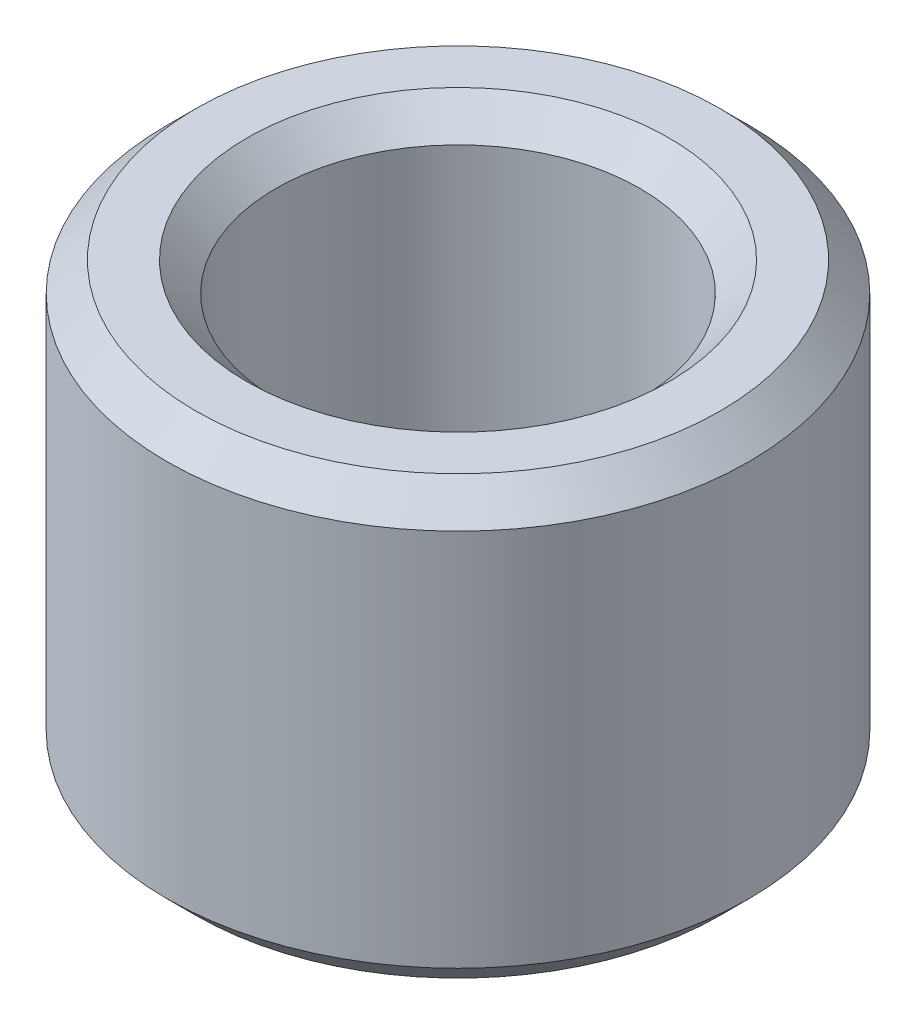
ISO-10303-21;
HEADER;
FILE_DESCRIPTION(('STEP AP214'),'2;1');
FILE_NAME('part.step','',(''),(''),'','','');
FILE_SCHEMA(('AUTOMOTIVE_DESIGN { 1 0 10303 214 1 1 1 1 }'));
ENDSEC;
DATA;
#1=APPLICATION_CONTEXT('core data for automotive mechanical design processes');
#2=APPLICATION_PROTOCOL_DEFINITION('international standard','automotive_design',2000,#1);
#3=PRODUCT_CONTEXT('',#1,'mechanical');
#4=PRODUCT('Part','Part','',(#3));
#5=PRODUCT_RELATED_PRODUCT_CATEGORY('part','',(#4));
#6=PRODUCT_DEFINITION_FORMATION('','',#4);
#7=PRODUCT_DEFINITION_CONTEXT('part definition',#1,'design');
#8=PRODUCT_DEFINITION('design','',#6,#7);
#9=PRODUCT_DEFINITION_SHAPE('','',#8);
#10=(LENGTH_UNIT() NAMED_UNIT(*) SI_UNIT(.MILLI.,.METRE.));
#11=(NAMED_UNIT(*) PLANE_ANGLE_UNIT() SI_UNIT($,.RADIAN.));
#12=(NAMED_UNIT(*) SI_UNIT($,.STERADIAN.) SOLID_ANGLE_UNIT());
#13=UNCERTAINTY_MEASURE_WITH_UNIT(LENGTH_MEASURE(1.E-05),#10,'distance_accuracy_value','');
#14=(GEOMETRIC_REPRESENTATION_CONTEXT(3) GLOBAL_UNCERTAINTY_ASSIGNED_CONTEXT((#13)) GLOBAL_UNIT_ASSIGNED_CONTEXT((#10,
#11,#12)) REPRESENTATION_CONTEXT('',''));
#15=CARTESIAN_POINT('',(0.,0.,0.));
#16=DIRECTION('',(0.,0.,1.));
#17=DIRECTION('',(1.,0.,0.));
#18=AXIS2_PLACEMENT_3D('',#15,#16,#17);
#19=CARTESIAN_POINT('',(0.,3.,0.));
#20=DIRECTION('',(0.,1.,0.));
#21=DIRECTION('',(0.,0.,1.));
#22=AXIS2_PLACEMENT_3D('',#19,#20,#21);
#23=PLANE('',#22);
#24=CARTESIAN_POINT('',(0.,3.,0.));
#25=DIRECTION('',(0.,1.,0.));
#26=DIRECTION('',(0.,0.,1.));
#27=AXIS2_PLACEMENT_3D('',#24,#25,#26);
#28=CIRCLE('',#27,1.45);
#29=CARTESIAN_POINT('',(0.,3.,1.45));
#30=VERTEX_POINT('',#29);
#31=EDGE_CURVE('E59',#30,#30,#28,.F.);
#32=ORIENTED_EDGE('',*,*,#31,.T.);
#33=EDGE_LOOP('',(#32));
#34=FACE_BOUND('',#33,.T.);
#35=CARTESIAN_POINT('',(0.,3.,0.));
#36=DIRECTION('',(0.,1.,0.));
#37=DIRECTION('',(0.,0.,1.));
#38=AXIS2_PLACEMENT_3D('',#35,#36,#37);
#39=CIRCLE('',#38,1.8);
#40=CARTESIAN_POINT('',(0.,3.,1.8));
#41=VERTEX_POINT('',#40);
#42=EDGE_CURVE('E64',#41,#41,#39,.T.);
#43=ORIENTED_EDGE('',*,*,#42,.T.);
#44=EDGE_LOOP('',(#43));
#45=FACE_BOUND('',#44,.T.);
#46=ADVANCED_FACE('F45',(#34,#45),#23,.T.);
#47=CARTESIAN_POINT('',(0.,0.,0.));
#48=DIRECTION('',(0.,1.,0.));
#49=DIRECTION('',(0.,0.,1.));
#50=AXIS2_PLACEMENT_3D('',#47,#48,#49);
#51=PLANE('',#50);
#52=CARTESIAN_POINT('',(0.,0.,0.));
#53=DIRECTION('',(0.,1.,0.));
#54=DIRECTION('',(0.,0.,1.));
#55=AXIS2_PLACEMENT_3D('',#52,#53,#54);
#56=CIRCLE('',#55,1.45);
#57=CARTESIAN_POINT('',(0.,0.,1.45));
#58=VERTEX_POINT('',#57);
#59=EDGE_CURVE('E78',#58,#58,#56,.T.);
#60=ORIENTED_EDGE('',*,*,#59,.T.);
#61=EDGE_LOOP('',(#60));
#62=FACE_BOUND('',#61,.T.);
#63=CARTESIAN_POINT('',(0.,0.,0.));
#64=DIRECTION('',(0.,1.,0.));
#65=DIRECTION('',(0.,0.,1.));
#66=AXIS2_PLACEMENT_3D('',#63,#64,#65);
#67=CIRCLE('',#66,1.8);
#68=CARTESIAN_POINT('',(0.,0.,1.8));
#69=VERTEX_POINT('',#68);
#70=EDGE_CURVE('E82',#69,#69,#67,.F.);
#71=ORIENTED_EDGE('',*,*,#70,.T.);
#72=EDGE_LOOP('',(#71));
#73=FACE_BOUND('',#72,.T.);
#74=ADVANCED_FACE('F87',(#62,#73),#51,.F.);
#75=CARTESIAN_POINT('',(0.,3.,0.));
#76=DIRECTION('',(0.,-1.,0.));
#77=DIRECTION('',(0.,0.,-1.));
#78=AXIS2_PLACEMENT_3D('',#75,#76,#77);
#79=CYLINDRICAL_SURFACE('',#78,2.);
#80=CARTESIAN_POINT('',(0.,0.2,0.));
#81=DIRECTION('',(0.,1.,0.));
#82=DIRECTION('',(0.,0.,1.));
#83=AXIS2_PLACEMENT_3D('',#80,#81,#82);
#84=CIRCLE('',#83,2.);
#85=CARTESIAN_POINT('',(0.,0.2,2.));
#86=VERTEX_POINT('',#85);
#87=EDGE_CURVE('E10',#86,#86,#84,.T.);
#88=ORIENTED_EDGE('',*,*,#87,.T.);
#89=EDGE_LOOP('',(#88));
#90=FACE_BOUND('',#89,.T.);
#91=CARTESIAN_POINT('',(0.,2.8,0.));
#92=DIRECTION('',(0.,1.,0.));
#93=DIRECTION('',(0.,0.,1.));
#94=AXIS2_PLACEMENT_3D('',#91,#92,#93);
#95=CIRCLE('',#94,2.);
#96=CARTESIAN_POINT('',(0.,2.8,2.));
#97=VERTEX_POINT('',#96);
#98=EDGE_CURVE('E54',#97,#97,#95,.F.);
#99=ORIENTED_EDGE('',*,*,#98,.T.);
#100=EDGE_LOOP('',(#99));
#101=FACE_BOUND('',#100,.T.);
#102=ADVANCED_FACE('F108',(#90,#101),#79,.T.);
#103=CARTESIAN_POINT('',(0.,3.,0.));
#104=DIRECTION('',(0.,-1.,0.));
#105=DIRECTION('',(0.,0.,-1.));
#106=AXIS2_PLACEMENT_3D('',#103,#104,#105);
#107=CYLINDRICAL_SURFACE('',#106,1.25);
#108=CARTESIAN_POINT('',(0.,0.200000000000001,0.));
#109=DIRECTION('',(0.,1.,0.));
#110=DIRECTION('',(0.,0.,1.));
#111=AXIS2_PLACEMENT_3D('',#108,#109,#110);
#112=CIRCLE('',#111,1.25);
#113=CARTESIAN_POINT('',(0.,0.200000000000001,1.25));
#114=VERTEX_POINT('',#113);
#115=EDGE_CURVE('E70',#114,#114,#112,.F.);
#116=ORIENTED_EDGE('',*,*,#115,.T.);
#117=EDGE_LOOP('',(#116));
#118=FACE_BOUND('',#117,.T.);
#119=CARTESIAN_POINT('',(0.,2.8,0.));
#120=DIRECTION('',(0.,1.,0.));
#121=DIRECTION('',(0.,0.,1.));
#122=AXIS2_PLACEMENT_3D('',#119,#120,#121);
#123=CIRCLE('',#122,1.25);
#124=CARTESIAN_POINT('',(0.,2.8,1.25));
#125=VERTEX_POINT('',#124);
#126=EDGE_CURVE('E74',#125,#125,#123,.T.);
#127=ORIENTED_EDGE('',*,*,#126,.T.);
#128=EDGE_LOOP('',(#127));
#129=FACE_BOUND('',#128,.T.);
#130=ADVANCED_FACE('F113',(#118,#129),#107,.F.);
#131=CARTESIAN_POINT('',(0.,0.,0.));
#132=DIRECTION('',(0.,-1.,0.));
#133=DIRECTION('',(0.,0.,-1.));
#134=AXIS2_PLACEMENT_3D('',#131,#132,#133);
#135=CONICAL_SURFACE('',#134,1.45,0.785398163397448);
#136=ORIENTED_EDGE('',*,*,#115,.F.);
#137=EDGE_LOOP('',(#136));
#138=FACE_BOUND('',#137,.T.);
#139=ORIENTED_EDGE('',*,*,#59,.F.);
#140=EDGE_LOOP('',(#139));
#141=FACE_BOUND('',#140,.T.);
#142=ADVANCED_FACE('F98',(#138,#141),#135,.F.);
#143=CARTESIAN_POINT('',(0.,2.8,0.));
#144=DIRECTION('',(0.,1.,0.));
#145=DIRECTION('',(0.,0.,1.));
#146=AXIS2_PLACEMENT_3D('',#143,#144,#145);
#147=CONICAL_SURFACE('',#146,1.25,0.785398163397451);
#148=ORIENTED_EDGE('',*,*,#31,.F.);
#149=EDGE_LOOP('',(#148));
#150=FACE_BOUND('',#149,.T.);
#151=ORIENTED_EDGE('',*,*,#126,.F.);
#152=EDGE_LOOP('',(#151));
#153=FACE_BOUND('',#152,.T.);
#154=ADVANCED_FACE('F92',(#150,#153),#147,.F.);
#155=CARTESIAN_POINT('',(0.,0.2,0.));
#156=DIRECTION('',(0.,1.,0.));
#157=DIRECTION('',(0.,0.,1.));
#158=AXIS2_PLACEMENT_3D('',#155,#156,#157);
#159=CONICAL_SURFACE('',#158,2.,0.78539816339745);
#160=ORIENTED_EDGE('',*,*,#70,.F.);
#161=EDGE_LOOP('',(#160));
#162=FACE_BOUND('',#161,.T.);
#163=ORIENTED_EDGE('',*,*,#87,.F.);
#164=EDGE_LOOP('',(#163));
#165=FACE_BOUND('',#164,.T.);
#166=ADVANCED_FACE('F89',(#162,#165),#159,.T.);
#167=CARTESIAN_POINT('',(0.,3.,0.));
#168=DIRECTION('',(0.,-1.,0.));
#169=DIRECTION('',(0.,0.,-1.));
#170=AXIS2_PLACEMENT_3D('',#167,#168,#169);
#171=CONICAL_SURFACE('',#170,1.8,0.785398163397447);
#172=ORIENTED_EDGE('',*,*,#98,.F.);
#173=EDGE_LOOP('',(#172));
#174=FACE_BOUND('',#173,.T.);
#175=ORIENTED_EDGE('',*,*,#42,.F.);
#176=EDGE_LOOP('',(#175));
#177=FACE_BOUND('',#176,.T.);
#178=ADVANCED_FACE('F48',(#174,#177),#171,.T.);
#179=CLOSED_SHELL('',(#46,#74,#102,#130,#142,#154,#166,#178));
#180=MANIFOLD_SOLID_BREP('B2',#179);
#181=ADVANCED_BREP_SHAPE_REPRESENTATION('',(#18,#180),#14);
#182=SHAPE_DEFINITION_REPRESENTATION(#9,#181);
ENDSEC;
END-ISO-10303-21;
